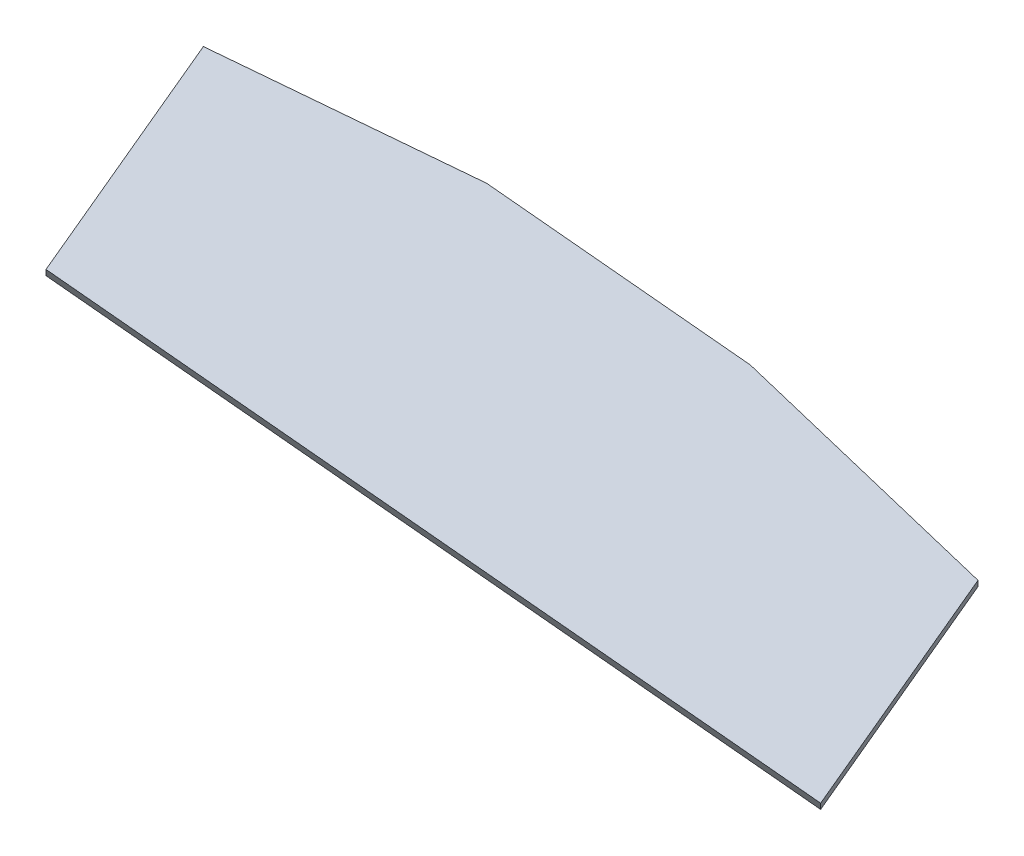
ISO-10303-21;
HEADER;
FILE_DESCRIPTION(('STEP AP214'),'2;1');
FILE_NAME('part.step','',(''),(''),'','','');
FILE_SCHEMA(('AUTOMOTIVE_DESIGN { 1 0 10303 214 1 1 1 1 }'));
ENDSEC;
DATA;
#1=APPLICATION_CONTEXT('core data for automotive mechanical design processes');
#2=APPLICATION_PROTOCOL_DEFINITION('international standard','automotive_design',2000,#1);
#3=PRODUCT_CONTEXT('',#1,'mechanical');
#4=PRODUCT('Part','Part','',(#3));
#5=PRODUCT_RELATED_PRODUCT_CATEGORY('part','',(#4));
#6=PRODUCT_DEFINITION_FORMATION('','',#4);
#7=PRODUCT_DEFINITION_CONTEXT('part definition',#1,'design');
#8=PRODUCT_DEFINITION('design','',#6,#7);
#9=PRODUCT_DEFINITION_SHAPE('','',#8);
#10=(LENGTH_UNIT() NAMED_UNIT(*) SI_UNIT(.MILLI.,.METRE.));
#11=(NAMED_UNIT(*) PLANE_ANGLE_UNIT() SI_UNIT($,.RADIAN.));
#12=(NAMED_UNIT(*) SI_UNIT($,.STERADIAN.) SOLID_ANGLE_UNIT());
#13=UNCERTAINTY_MEASURE_WITH_UNIT(LENGTH_MEASURE(1.E-05),#10,'distance_accuracy_value','');
#14=(GEOMETRIC_REPRESENTATION_CONTEXT(3) GLOBAL_UNCERTAINTY_ASSIGNED_CONTEXT((#13)) GLOBAL_UNIT_ASSIGNED_CONTEXT((#10,
#11,#12)) REPRESENTATION_CONTEXT('',''));
#15=CARTESIAN_POINT('',(0.,0.,0.));
#16=DIRECTION('',(0.,0.,1.));
#17=DIRECTION('',(1.,0.,0.));
#18=AXIS2_PLACEMENT_3D('',#15,#16,#17);
#19=CARTESIAN_POINT('',(103.15,96.7835201836263,-226.60015636851));
#20=DIRECTION('',(0.861869993314885,-0.410276212238365,-0.298083116420136));
#21=DIRECTION('',(-0.488342371027511,-0.512932048578426,-0.705990398093606));
#22=AXIS2_PLACEMENT_3D('',#19,#20,#21);
#23=PLANE('',#22);
#24=DIRECTION('',(0.,0.587785252292484,-0.809016994374939));
#25=VECTOR('',#24,1.);
#26=CARTESIAN_POINT('',(98.0787071212226,42.7880252848921,-166.944741533154));
#27=LINE('',#26,#25);
#28=CARTESIAN_POINT('',(98.0787071212225,42.7880252848921,-166.944741533154));
#29=VERTEX_POINT('',#28);
#30=CARTESIAN_POINT('',(98.0787071212225,82.7574224407808,-221.957897150649));
#31=VERTEX_POINT('',#30);
#32=EDGE_CURVE('E101',#29,#31,#27,.T.);
#33=ORIENTED_EDGE('',*,*,#32,.T.);
#34=DIRECTION('',(0.507129287877757,0.697267471533558,0.506594471463911));
#35=VECTOR('',#34,1.);
#36=CARTESIAN_POINT('',(-36.3180180428493,-102.028719826222,-356.212888093679));
#37=LINE('',#36,#35);
#38=CARTESIAN_POINT('',(103.15,89.7300971561163,-216.89195243601));
#39=VERTEX_POINT('',#38);
#40=EDGE_CURVE('E50',#31,#39,#37,.T.);
#41=ORIENTED_EDGE('',*,*,#40,.T.);
#42=DIRECTION('',(0.,-0.587785252292484,0.809016994374939));
#43=VECTOR('',#42,1.);
#44=CARTESIAN_POINT('',(103.15,49.7607000002276,-161.878796818515));
#45=LINE('',#44,#43);
#46=CARTESIAN_POINT('',(103.15,49.7607000002276,-161.878796818514));
#47=VERTEX_POINT('',#46);
#48=EDGE_CURVE('E98',#39,#47,#45,.T.);
#49=ORIENTED_EDGE('',*,*,#48,.T.);
#50=DIRECTION('',(-0.507129287877757,-0.697267471533558,-0.50659447146391));
#51=VECTOR('',#50,1.);
#52=CARTESIAN_POINT('',(103.15,49.7607000002276,-161.878796818515));
#53=LINE('',#52,#51);
#54=EDGE_CURVE('E112',#47,#29,#53,.T.);
#55=ORIENTED_EDGE('',*,*,#54,.T.);
#56=EDGE_LOOP('',(#33,#41,#49,#55));
#57=FACE_BOUND('',#56,.T.);
#58=ADVANCED_FACE('F36',(#57),#23,.T.);
#59=CARTESIAN_POINT('',(-101.614353560611,147.234732083848,-91.0597671336027));
#60=DIRECTION('',(-0.507129287877756,-0.697267471533558,-0.50659447146391));
#61=DIRECTION('',(-0.850402573927694,0.309252954807168,0.425650175848887));
#62=AXIS2_PLACEMENT_3D('',#59,#60,#61);
#63=PLANE('',#62);
#64=DIRECTION('',(-0.851590573142062,0.4958932566867,0.169951092106621));
#65=VECTOR('',#64,1.);
#66=CARTESIAN_POINT('',(34.8472909761066,129.503732382504,-203.26084805492));
#67=LINE('',#66,#65);
#68=CARTESIAN_POINT('',(36.7860105147525,128.374788525981,-203.647756404159));
#69=VERTEX_POINT('',#68);
#70=EDGE_CURVE('E86',#39,#69,#67,.T.);
#71=ORIENTED_EDGE('',*,*,#70,.T.);
#72=DIRECTION('',(0.861869993314885,-0.410276212238365,-0.298083116420136));
#73=VECTOR('',#72,1.);
#74=CARTESIAN_POINT('',(-101.614353560611,194.257552267247,-155.781126683598));
#75=LINE('',#74,#73);
#76=CARTESIAN_POINT('',(-31.7147176359755,160.983209168586,-179.956352036218));
#77=VERTEX_POINT('',#76);
#78=EDGE_CURVE('E120',#77,#69,#75,.T.);
#79=ORIENTED_EDGE('',*,*,#78,.F.);
#80=DIRECTION('',(0.851590573142062,-0.314872537311597,-0.419104737485191));
#81=VECTOR('',#80,1.);
#82=CARTESIAN_POINT('',(-29.7759980973289,160.266374624473,-180.910480192315));
#83=LINE('',#82,#81);
#84=CARTESIAN_POINT('',(-98.0787071212225,185.521054483431,-147.295748139368));
#85=VERTEX_POINT('',#84);
#86=EDGE_CURVE('E134',#85,#77,#83,.T.);
#87=ORIENTED_EDGE('',*,*,#86,.F.);
#88=DIRECTION('',(0.,-0.587785252292484,0.809016994374939));
#89=VECTOR('',#88,1.);
#90=CARTESIAN_POINT('',(-98.0787071212225,145.551657327542,-92.2825925218718));
#91=LINE('',#90,#89);
#92=CARTESIAN_POINT('',(-98.0787071212225,145.551657327542,-92.2825925218718));
#93=VERTEX_POINT('',#92);
#94=EDGE_CURVE('E121',#85,#93,#91,.T.);
#95=ORIENTED_EDGE('',*,*,#94,.T.);
#96=DIRECTION('',(0.861869993314885,-0.410276212238365,-0.298083116420136));
#97=VECTOR('',#96,1.);
#98=CARTESIAN_POINT('',(-101.614353560611,147.234732083848,-91.0597671336027));
#99=LINE('',#98,#97);
#100=EDGE_CURVE('E105',#93,#47,#99,.T.);
#101=ORIENTED_EDGE('',*,*,#100,.T.);
#102=ORIENTED_EDGE('',*,*,#48,.F.);
#103=EDGE_LOOP('',(#71,#79,#87,#95,#101,#102));
#104=FACE_BOUND('',#103,.T.);
#105=ADVANCED_FACE('F103',(#104),#63,.F.);
#106=CARTESIAN_POINT('',(-106.685646439389,187.284877551911,-160.847071398237));
#107=DIRECTION('',(0.,-0.587785252292484,0.809016994374939));
#108=DIRECTION('',(0.,-0.809016994374939,-0.587785252292484));
#109=AXIS2_PLACEMENT_3D('',#106,#107,#108);
#110=PLANE('',#109);
#111=DIRECTION('',(0.507129287877757,0.697267471533558,0.506594471463911));
#112=VECTOR('',#111,1.);
#113=CARTESIAN_POINT('',(-102.682007528097,-63.384028456357,-342.968692061828));
#114=LINE('',#113,#112);
#115=CARTESIAN_POINT('',(31.7147176359749,121.402113810646,-208.713701118798));
#116=VERTEX_POINT('',#115);
#117=EDGE_CURVE('E89',#116,#69,#114,.T.);
#118=ORIENTED_EDGE('',*,*,#117,.F.);
#119=DIRECTION('',(0.861869993314885,-0.410276212238365,-0.298083116420136));
#120=VECTOR('',#119,1.);
#121=CARTESIAN_POINT('',(-106.685646439389,187.284877551911,-160.847071398237));
#122=LINE('',#121,#120);
#123=CARTESIAN_POINT('',(-36.7860105147532,154.01053445325,-185.022296750857));
#124=VERTEX_POINT('',#123);
#125=EDGE_CURVE('E119',#124,#116,#122,.T.);
#126=ORIENTED_EDGE('',*,*,#125,.F.);
#127=DIRECTION('',(0.507129287877757,0.697267471533558,0.506594471463911));
#128=VECTOR('',#127,1.);
#129=CARTESIAN_POINT('',(-171.182735678825,-30.7756078137523,-319.277287693887));
#130=LINE('',#129,#128);
#131=EDGE_CURVE('E58',#124,#77,#130,.T.);
#132=ORIENTED_EDGE('',*,*,#131,.T.);
#133=ORIENTED_EDGE('',*,*,#78,.T.);
#134=EDGE_LOOP('',(#118,#126,#132,#133));
#135=FACE_BOUND('',#134,.T.);
#136=ADVANCED_FACE('F133',(#135),#110,.F.);
#137=CARTESIAN_POINT('',(-106.685646439389,140.262057368513,-96.1257118482418));
#138=DIRECTION('',(0.507129287877756,0.697267471533558,0.506594471463911));
#139=DIRECTION('',(0.850402573927694,-0.309252954807168,-0.425650175848887));
#140=AXIS2_PLACEMENT_3D('',#137,#138,#139);
#141=PLANE('',#140);
#142=DIRECTION('',(-0.851590573142062,0.4958932566867,0.169951092106621));
#143=VECTOR('',#142,1.);
#144=CARTESIAN_POINT('',(-92.9133621758141,193.974810505079,-183.841797954093));
#145=LINE('',#144,#143);
#146=EDGE_CURVE('E11',#31,#116,#145,.T.);
#147=ORIENTED_EDGE('',*,*,#146,.F.);
#148=ORIENTED_EDGE('',*,*,#32,.F.);
#149=DIRECTION('',(0.861869993314885,-0.410276212238365,-0.298083116420136));
#150=VECTOR('',#149,1.);
#151=CARTESIAN_POINT('',(-106.685646439389,140.262057368513,-96.1257118482418));
#152=LINE('',#151,#150);
#153=CARTESIAN_POINT('',(-103.15,138.578982612206,-97.3485372365109));
#154=VERTEX_POINT('',#153);
#155=EDGE_CURVE('E110',#154,#29,#152,.T.);
#156=ORIENTED_EDGE('',*,*,#155,.F.);
#157=DIRECTION('',(0.,0.587785252292484,-0.809016994374939));
#158=VECTOR('',#157,1.);
#159=CARTESIAN_POINT('',(-103.15,138.578982612206,-97.3485372365109));
#160=LINE('',#159,#158);
#161=CARTESIAN_POINT('',(-103.15,178.548379768095,-152.361692854007));
#162=VERTEX_POINT('',#161);
#163=EDGE_CURVE('E116',#154,#162,#160,.T.);
#164=ORIENTED_EDGE('',*,*,#163,.T.);
#165=DIRECTION('',(0.851590573142062,-0.314872537311597,-0.419104737485191));
#166=VECTOR('',#165,1.);
#167=CARTESIAN_POINT('',(-115.518823177852,183.121707445031,-146.274457327399));
#168=LINE('',#167,#166);
#169=EDGE_CURVE('E44',#162,#124,#168,.T.);
#170=ORIENTED_EDGE('',*,*,#169,.T.);
#171=ORIENTED_EDGE('',*,*,#125,.T.);
#172=EDGE_LOOP('',(#147,#148,#156,#164,#170,#171));
#173=FACE_BOUND('',#172,.T.);
#174=ADVANCED_FACE('F129',(#173),#141,.F.);
#175=CARTESIAN_POINT('',(-100.614353560611,47.8954786636569,34.7981021483213));
#176=DIRECTION('',(0.861869993314885,-0.410276212238365,-0.298083116420136));
#177=DIRECTION('',(-0.488342371027511,-0.512932048578425,-0.705990398093606));
#178=AXIS2_PLACEMENT_3D('',#175,#176,#177);
#179=PLANE('',#178);
#180=ORIENTED_EDGE('',*,*,#94,.F.);
#181=DIRECTION('',(0.507129287877757,0.697267471533558,0.506594471463911));
#182=VECTOR('',#181,1.);
#183=CARTESIAN_POINT('',(-237.546725164072,-6.23776249890753,-286.616683797037));
#184=LINE('',#183,#182);
#185=EDGE_CURVE('E136',#162,#85,#184,.T.);
#186=ORIENTED_EDGE('',*,*,#185,.F.);
#187=ORIENTED_EDGE('',*,*,#163,.F.);
#188=DIRECTION('',(-0.507129287877757,-0.697267471533558,-0.50659447146391));
#189=VECTOR('',#188,1.);
#190=CARTESIAN_POINT('',(-98.0787071212225,145.551657327542,-92.2825925218718));
#191=LINE('',#190,#189);
#192=EDGE_CURVE('E107',#93,#154,#191,.T.);
#193=ORIENTED_EDGE('',*,*,#192,.F.);
#194=EDGE_LOOP('',(#180,#186,#187,#193));
#195=FACE_BOUND('',#194,.T.);
#196=ADVANCED_FACE('F38',(#195),#179,.F.);
#197=CARTESIAN_POINT('',(-101.614353560611,147.234732083848,-91.0597671336027));
#198=DIRECTION('',(0.,0.587785252292483,-0.80901699437494));
#199=DIRECTION('',(0.,0.80901699437494,0.587785252292484));
#200=AXIS2_PLACEMENT_3D('',#197,#198,#199);
#201=PLANE('',#200);
#202=ORIENTED_EDGE('',*,*,#100,.F.);
#203=ORIENTED_EDGE('',*,*,#192,.T.);
#204=ORIENTED_EDGE('',*,*,#155,.T.);
#205=ORIENTED_EDGE('',*,*,#54,.F.);
#206=EDGE_LOOP('',(#202,#203,#204,#205));
#207=FACE_BOUND('',#206,.T.);
#208=ADVANCED_FACE('F141',(#207),#201,.F.);
#209=CARTESIAN_POINT('',(-169.244016140178,-31.4924423578653,-320.231415849984));
#210=DIRECTION('',(0.132715413996165,-0.643951363371611,0.753467491335671));
#211=DIRECTION('',(0.,-0.760192009041551,-0.649698475748074));
#212=AXIS2_PLACEMENT_3D('',#209,#210,#211);
#213=PLANE('',#212);
#214=ORIENTED_EDGE('',*,*,#185,.T.);
#215=ORIENTED_EDGE('',*,*,#86,.T.);
#216=ORIENTED_EDGE('',*,*,#131,.F.);
#217=ORIENTED_EDGE('',*,*,#169,.F.);
#218=EDGE_LOOP('',(#214,#215,#216,#217));
#219=FACE_BOUND('',#218,.T.);
#220=ADVANCED_FACE('F146',(#219),#213,.F.);
#221=CARTESIAN_POINT('',(-104.620727066743,-62.2550845998344,-342.581783712589));
#222=DIRECTION('',(0.132715413996165,0.517598252618629,-0.845268399843486));
#223=DIRECTION('',(0.,0.852812218769094,0.522217693608839));
#224=AXIS2_PLACEMENT_3D('',#221,#222,#223);
#225=PLANE('',#224);
#226=ORIENTED_EDGE('',*,*,#146,.T.);
#227=ORIENTED_EDGE('',*,*,#117,.T.);
#228=ORIENTED_EDGE('',*,*,#70,.F.);
#229=ORIENTED_EDGE('',*,*,#40,.F.);
#230=EDGE_LOOP('',(#226,#227,#228,#229));
#231=FACE_BOUND('',#230,.T.);
#232=ADVANCED_FACE('F87',(#231),#225,.T.);
#233=CLOSED_SHELL('',(#58,#105,#136,#174,#196,#208,#220,#232));
#234=MANIFOLD_SOLID_BREP('B2',#233);
#235=ADVANCED_BREP_SHAPE_REPRESENTATION('',(#18,#234),#14);
#236=SHAPE_DEFINITION_REPRESENTATION(#9,#235);
ENDSEC;
END-ISO-10303-21;
